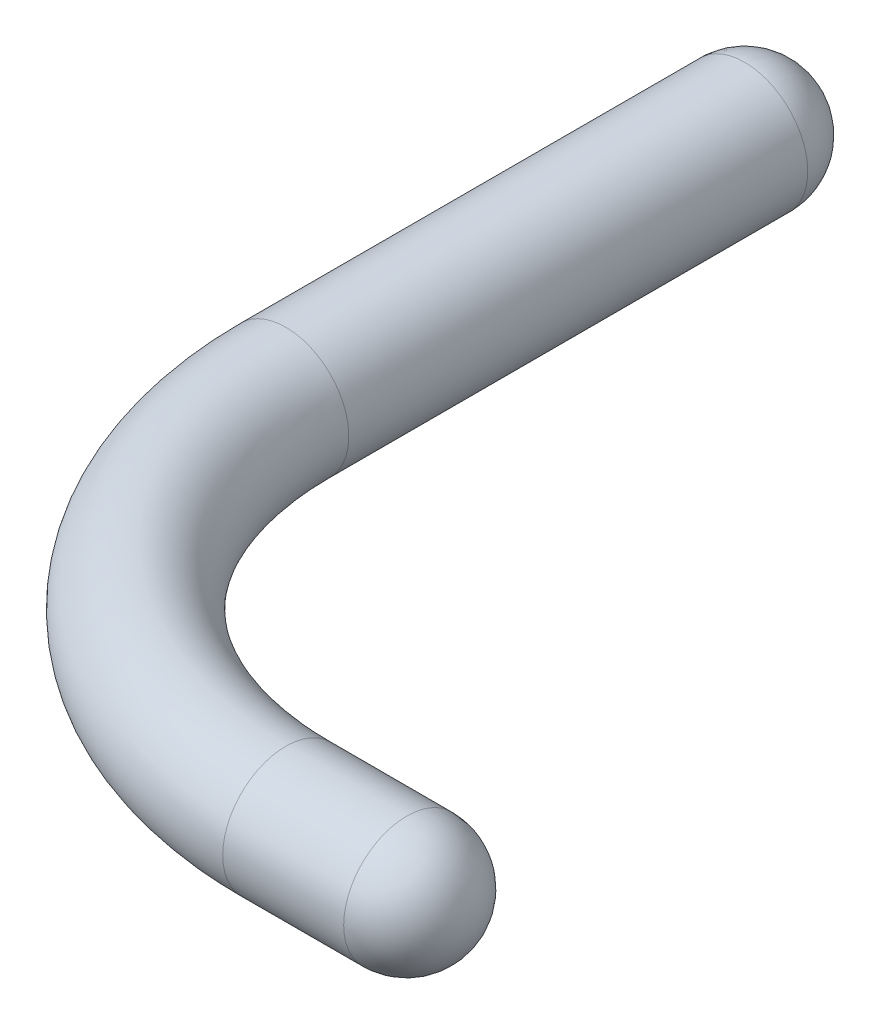
ISO-10303-21;
HEADER;
FILE_DESCRIPTION(('STEP AP214'),'2;1');
FILE_NAME('part.step','',(''),(''),'','','');
FILE_SCHEMA(('AUTOMOTIVE_DESIGN { 1 0 10303 214 1 1 1 1 }'));
ENDSEC;
DATA;
#1=APPLICATION_CONTEXT('core data for automotive mechanical design processes');
#2=APPLICATION_PROTOCOL_DEFINITION('international standard','automotive_design',2000,#1);
#3=PRODUCT_CONTEXT('',#1,'mechanical');
#4=PRODUCT('Part','Part','',(#3));
#5=PRODUCT_RELATED_PRODUCT_CATEGORY('part','',(#4));
#6=PRODUCT_DEFINITION_FORMATION('','',#4);
#7=PRODUCT_DEFINITION_CONTEXT('part definition',#1,'design');
#8=PRODUCT_DEFINITION('design','',#6,#7);
#9=PRODUCT_DEFINITION_SHAPE('','',#8);
#10=(LENGTH_UNIT() NAMED_UNIT(*) SI_UNIT(.MILLI.,.METRE.));
#11=(NAMED_UNIT(*) PLANE_ANGLE_UNIT() SI_UNIT($,.RADIAN.));
#12=(NAMED_UNIT(*) SI_UNIT($,.STERADIAN.) SOLID_ANGLE_UNIT());
#13=UNCERTAINTY_MEASURE_WITH_UNIT(LENGTH_MEASURE(1.E-05),#10,'distance_accuracy_value','');
#14=(GEOMETRIC_REPRESENTATION_CONTEXT(3) GLOBAL_UNCERTAINTY_ASSIGNED_CONTEXT((#13)) GLOBAL_UNIT_ASSIGNED_CONTEXT((#10,
#11,#12)) REPRESENTATION_CONTEXT('',''));
#15=CARTESIAN_POINT('',(0.,0.,0.));
#16=DIRECTION('',(0.,0.,1.));
#17=DIRECTION('',(1.,0.,0.));
#18=AXIS2_PLACEMENT_3D('',#15,#16,#17);
#19=CARTESIAN_POINT('',(0.,0.,-3.));
#20=DIRECTION('',(1.,0.,0.));
#21=DIRECTION('',(0.,1.,0.));
#22=AXIS2_PLACEMENT_3D('',#19,#20,#21);
#23=SPHERICAL_SURFACE('',#22,0.331);
#24=CARTESIAN_POINT('',(0.,0.,-3.));
#25=DIRECTION('',(0.,0.,1.));
#26=DIRECTION('',(1.,0.,0.));
#27=AXIS2_PLACEMENT_3D('',#24,#25,#26);
#28=CIRCLE('',#27,0.331);
#29=CARTESIAN_POINT('',(0.331,0.,-3.));
#30=VERTEX_POINT('',#29);
#31=CARTESIAN_POINT('',(-0.331,0.,-3.));
#32=VERTEX_POINT('',#31);
#33=EDGE_CURVE('E44',#30,#32,#28,.T.);
#34=ORIENTED_EDGE('',*,*,#33,.F.);
#35=CARTESIAN_POINT('',(0.,0.,-3.));
#36=DIRECTION('',(0.,0.,1.));
#37=DIRECTION('',(1.,0.,0.));
#38=AXIS2_PLACEMENT_3D('',#35,#36,#37);
#39=CIRCLE('',#38,0.331);
#40=EDGE_CURVE('E42',#32,#30,#39,.T.);
#41=ORIENTED_EDGE('',*,*,#40,.F.);
#42=EDGE_LOOP('',(#34,#41));
#43=FACE_BOUND('',#42,.T.);
#44=ADVANCED_FACE('F17',(#43),#23,.T.);
#45=CARTESIAN_POINT('',(2.54,0.,1.3142));
#46=DIRECTION('',(0.,0.,1.));
#47=DIRECTION('',(0.,1.,0.));
#48=AXIS2_PLACEMENT_3D('',#45,#46,#47);
#49=SPHERICAL_SURFACE('',#48,0.331);
#50=CARTESIAN_POINT('',(2.54,0.,1.3142));
#51=DIRECTION('',(1.,0.,0.));
#52=DIRECTION('',(0.,0.,-1.));
#53=AXIS2_PLACEMENT_3D('',#50,#51,#52);
#54=CIRCLE('',#53,0.331);
#55=CARTESIAN_POINT('',(2.54,0.,1.6452));
#56=VERTEX_POINT('',#55);
#57=CARTESIAN_POINT('',(2.54,0.,0.9832));
#58=VERTEX_POINT('',#57);
#59=EDGE_CURVE('E34',#56,#58,#54,.F.);
#60=ORIENTED_EDGE('',*,*,#59,.F.);
#61=CARTESIAN_POINT('',(2.54,0.,1.3142));
#62=DIRECTION('',(1.,0.,0.));
#63=DIRECTION('',(0.,0.,-1.));
#64=AXIS2_PLACEMENT_3D('',#61,#62,#63);
#65=CIRCLE('',#64,0.331);
#66=EDGE_CURVE('E47',#58,#56,#65,.F.);
#67=ORIENTED_EDGE('',*,*,#66,.F.);
#68=EDGE_LOOP('',(#60,#67));
#69=FACE_BOUND('',#68,.T.);
#70=ADVANCED_FACE('F54',(#69),#49,.T.);
#71=CARTESIAN_POINT('',(0.,0.,-3.));
#72=DIRECTION('',(0.,0.,1.));
#73=DIRECTION('',(1.,0.,0.));
#74=AXIS2_PLACEMENT_3D('',#71,#72,#73);
#75=CYLINDRICAL_SURFACE('',#74,0.331);
#76=CARTESIAN_POINT('',(0.,0.,-0.5908));
#77=DIRECTION('',(0.,0.,1.));
#78=DIRECTION('',(-1.,0.,0.));
#79=AXIS2_PLACEMENT_3D('',#76,#77,#78);
#80=CIRCLE('',#79,0.331);
#81=CARTESIAN_POINT('',(-0.331,0.,-0.590800000000001));
#82=VERTEX_POINT('',#81);
#83=EDGE_CURVE('E26',#82,#82,#80,.T.);
#84=ORIENTED_EDGE('',*,*,#83,.F.);
#85=EDGE_LOOP('',(#84));
#86=FACE_BOUND('',#85,.T.);
#87=ORIENTED_EDGE('',*,*,#40,.T.);
#88=ORIENTED_EDGE('',*,*,#33,.T.);
#89=EDGE_LOOP('',(#87,#88));
#90=FACE_BOUND('',#89,.T.);
#91=ADVANCED_FACE('F46',(#86,#90),#75,.T.);
#92=CARTESIAN_POINT('',(1.905,0.,1.3142));
#93=DIRECTION('',(1.,0.,0.));
#94=DIRECTION('',(0.,0.,-1.));
#95=AXIS2_PLACEMENT_3D('',#92,#93,#94);
#96=CYLINDRICAL_SURFACE('',#95,0.331);
#97=ORIENTED_EDGE('',*,*,#59,.T.);
#98=ORIENTED_EDGE('',*,*,#66,.T.);
#99=EDGE_LOOP('',(#97,#98));
#100=FACE_BOUND('',#99,.T.);
#101=CARTESIAN_POINT('',(1.905,0.,1.3142));
#102=DIRECTION('',(1.,0.,0.));
#103=DIRECTION('',(0.,0.,1.));
#104=AXIS2_PLACEMENT_3D('',#101,#102,#103);
#105=CIRCLE('',#104,0.331);
#106=CARTESIAN_POINT('',(1.905,0.,1.6452));
#107=VERTEX_POINT('',#106);
#108=EDGE_CURVE('E11',#107,#107,#105,.F.);
#109=ORIENTED_EDGE('',*,*,#108,.F.);
#110=EDGE_LOOP('',(#109));
#111=FACE_BOUND('',#110,.T.);
#112=ADVANCED_FACE('F59',(#100,#111),#96,.T.);
#113=CARTESIAN_POINT('',(1.905,0.,-0.5908));
#114=DIRECTION('',(0.,1.,0.));
#115=DIRECTION('',(0.,0.,1.));
#116=AXIS2_PLACEMENT_3D('',#113,#114,#115);
#117=TOROIDAL_SURFACE('',#116,1.905,0.331);
#118=ORIENTED_EDGE('',*,*,#108,.T.);
#119=EDGE_LOOP('',(#118));
#120=FACE_BOUND('',#119,.T.);
#121=ORIENTED_EDGE('',*,*,#83,.T.);
#122=EDGE_LOOP('',(#121));
#123=FACE_BOUND('',#122,.T.);
#124=ADVANCED_FACE('F63',(#120,#123),#117,.T.);
#125=CLOSED_SHELL('',(#44,#70,#91,#112,#124));
#126=MANIFOLD_SOLID_BREP('B1',#125);
#127=ADVANCED_BREP_SHAPE_REPRESENTATION('',(#18,#126),#14);
#128=SHAPE_DEFINITION_REPRESENTATION(#9,#127);
ENDSEC;
END-ISO-10303-21;
